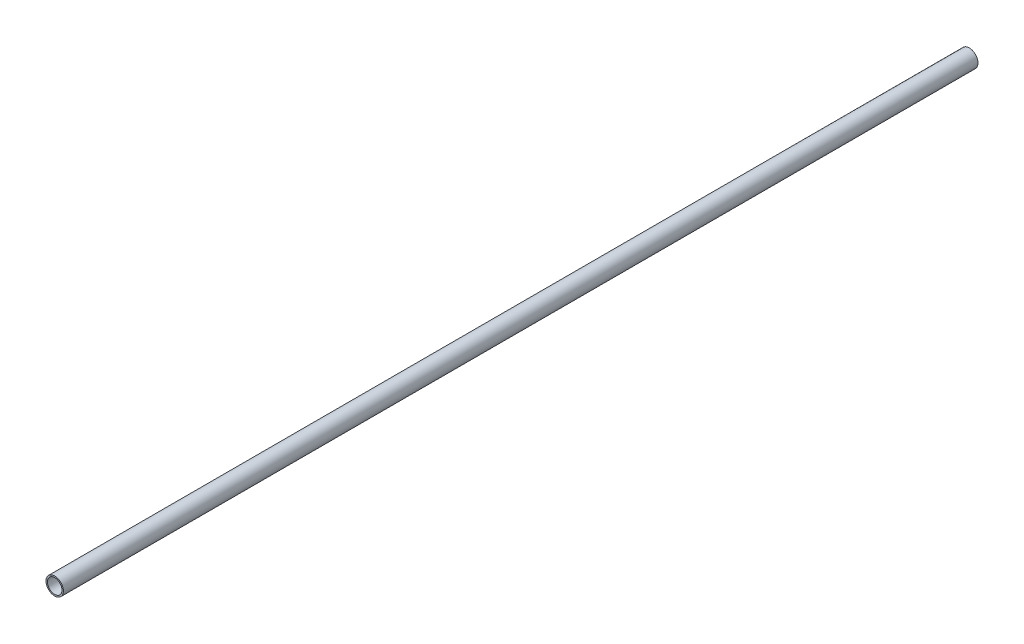
ISO-10303-21;
HEADER;
FILE_DESCRIPTION(('STEP AP214'),'2;1');
FILE_NAME('part.step','',(''),(''),'','','');
FILE_SCHEMA(('AUTOMOTIVE_DESIGN { 1 0 10303 214 1 1 1 1 }'));
ENDSEC;
DATA;
#1=APPLICATION_CONTEXT('core data for automotive mechanical design processes');
#2=APPLICATION_PROTOCOL_DEFINITION('international standard','automotive_design',2000,#1);
#3=PRODUCT_CONTEXT('',#1,'mechanical');
#4=PRODUCT('Part','Part','',(#3));
#5=PRODUCT_RELATED_PRODUCT_CATEGORY('part','',(#4));
#6=PRODUCT_DEFINITION_FORMATION('','',#4);
#7=PRODUCT_DEFINITION_CONTEXT('part definition',#1,'design');
#8=PRODUCT_DEFINITION('design','',#6,#7);
#9=PRODUCT_DEFINITION_SHAPE('','',#8);
#10=(LENGTH_UNIT() NAMED_UNIT(*) SI_UNIT(.MILLI.,.METRE.));
#11=(NAMED_UNIT(*) PLANE_ANGLE_UNIT() SI_UNIT($,.RADIAN.));
#12=(NAMED_UNIT(*) SI_UNIT($,.STERADIAN.) SOLID_ANGLE_UNIT());
#13=UNCERTAINTY_MEASURE_WITH_UNIT(LENGTH_MEASURE(1.E-05),#10,'distance_accuracy_value','');
#14=(GEOMETRIC_REPRESENTATION_CONTEXT(3) GLOBAL_UNCERTAINTY_ASSIGNED_CONTEXT((#13)) GLOBAL_UNIT_ASSIGNED_CONTEXT((#10,
#11,#12)) REPRESENTATION_CONTEXT('',''));
#15=CARTESIAN_POINT('',(0.,0.,0.));
#16=DIRECTION('',(0.,0.,1.));
#17=DIRECTION('',(1.,0.,0.));
#18=AXIS2_PLACEMENT_3D('',#15,#16,#17);
#19=CARTESIAN_POINT('',(0.,0.,1000.125));
#20=DIRECTION('',(0.,0.,1.));
#21=DIRECTION('',(1.,0.,0.));
#22=AXIS2_PLACEMENT_3D('',#19,#20,#21);
#23=PLANE('',#22);
#24=CARTESIAN_POINT('',(0.,0.,1000.125));
#25=DIRECTION('',(0.,0.,1.));
#26=DIRECTION('',(1.,0.,0.));
#27=AXIS2_PLACEMENT_3D('',#24,#25,#26);
#28=CIRCLE('',#27,9.525);
#29=CARTESIAN_POINT('',(9.525,0.,1000.125));
#30=VERTEX_POINT('',#29);
#31=EDGE_CURVE('E10',#30,#30,#28,.T.);
#32=ORIENTED_EDGE('',*,*,#31,.T.);
#33=EDGE_LOOP('',(#32));
#34=FACE_BOUND('',#33,.T.);
#35=CARTESIAN_POINT('',(0.,0.,1000.125));
#36=DIRECTION('',(0.,0.,1.));
#37=DIRECTION('',(1.,0.,0.));
#38=AXIS2_PLACEMENT_3D('',#35,#36,#37);
#39=CIRCLE('',#38,7.9375);
#40=CARTESIAN_POINT('',(7.9375,0.,1000.125));
#41=VERTEX_POINT('',#40);
#42=EDGE_CURVE('E48',#41,#41,#39,.T.);
#43=ORIENTED_EDGE('',*,*,#42,.F.);
#44=EDGE_LOOP('',(#43));
#45=FACE_BOUND('',#44,.T.);
#46=ADVANCED_FACE('F37',(#34,#45),#23,.T.);
#47=CARTESIAN_POINT('',(0.,0.,0.));
#48=DIRECTION('',(0.,0.,1.));
#49=DIRECTION('',(1.,0.,0.));
#50=AXIS2_PLACEMENT_3D('',#47,#48,#49);
#51=PLANE('',#50);
#52=CARTESIAN_POINT('',(0.,0.,0.));
#53=DIRECTION('',(0.,0.,1.));
#54=DIRECTION('',(1.,0.,0.));
#55=AXIS2_PLACEMENT_3D('',#52,#53,#54);
#56=CIRCLE('',#55,9.525);
#57=CARTESIAN_POINT('',(9.525,0.,0.));
#58=VERTEX_POINT('',#57);
#59=EDGE_CURVE('E41',#58,#58,#56,.T.);
#60=ORIENTED_EDGE('',*,*,#59,.F.);
#61=EDGE_LOOP('',(#60));
#62=FACE_BOUND('',#61,.T.);
#63=CARTESIAN_POINT('',(0.,0.,0.));
#64=DIRECTION('',(0.,0.,1.));
#65=DIRECTION('',(1.,0.,0.));
#66=AXIS2_PLACEMENT_3D('',#63,#64,#65);
#67=CIRCLE('',#66,7.9375);
#68=CARTESIAN_POINT('',(7.9375,0.,0.));
#69=VERTEX_POINT('',#68);
#70=EDGE_CURVE('E50',#69,#69,#67,.T.);
#71=ORIENTED_EDGE('',*,*,#70,.T.);
#72=EDGE_LOOP('',(#71));
#73=FACE_BOUND('',#72,.T.);
#74=ADVANCED_FACE('F60',(#62,#73),#51,.F.);
#75=CARTESIAN_POINT('',(0.,0.,1000.125));
#76=DIRECTION('',(0.,0.,-1.));
#77=DIRECTION('',(-1.,0.,0.));
#78=AXIS2_PLACEMENT_3D('',#75,#76,#77);
#79=CYLINDRICAL_SURFACE('',#78,9.525);
#80=ORIENTED_EDGE('',*,*,#31,.F.);
#81=EDGE_LOOP('',(#80));
#82=FACE_BOUND('',#81,.T.);
#83=ORIENTED_EDGE('',*,*,#59,.T.);
#84=EDGE_LOOP('',(#83));
#85=FACE_BOUND('',#84,.T.);
#86=ADVANCED_FACE('F39',(#82,#85),#79,.T.);
#87=CARTESIAN_POINT('',(0.,0.,1000.125));
#88=DIRECTION('',(0.,0.,-1.));
#89=DIRECTION('',(-1.,0.,0.));
#90=AXIS2_PLACEMENT_3D('',#87,#88,#89);
#91=CYLINDRICAL_SURFACE('',#90,7.9375);
#92=ORIENTED_EDGE('',*,*,#42,.T.);
#93=EDGE_LOOP('',(#92));
#94=FACE_BOUND('',#93,.T.);
#95=ORIENTED_EDGE('',*,*,#70,.F.);
#96=EDGE_LOOP('',(#95));
#97=FACE_BOUND('',#96,.T.);
#98=ADVANCED_FACE('F56',(#94,#97),#91,.F.);
#99=CLOSED_SHELL('',(#46,#74,#86,#98));
#100=MANIFOLD_SOLID_BREP('B2',#99);
#101=ADVANCED_BREP_SHAPE_REPRESENTATION('',(#18,#100),#14);
#102=SHAPE_DEFINITION_REPRESENTATION(#9,#101);
ENDSEC;
END-ISO-10303-21;
